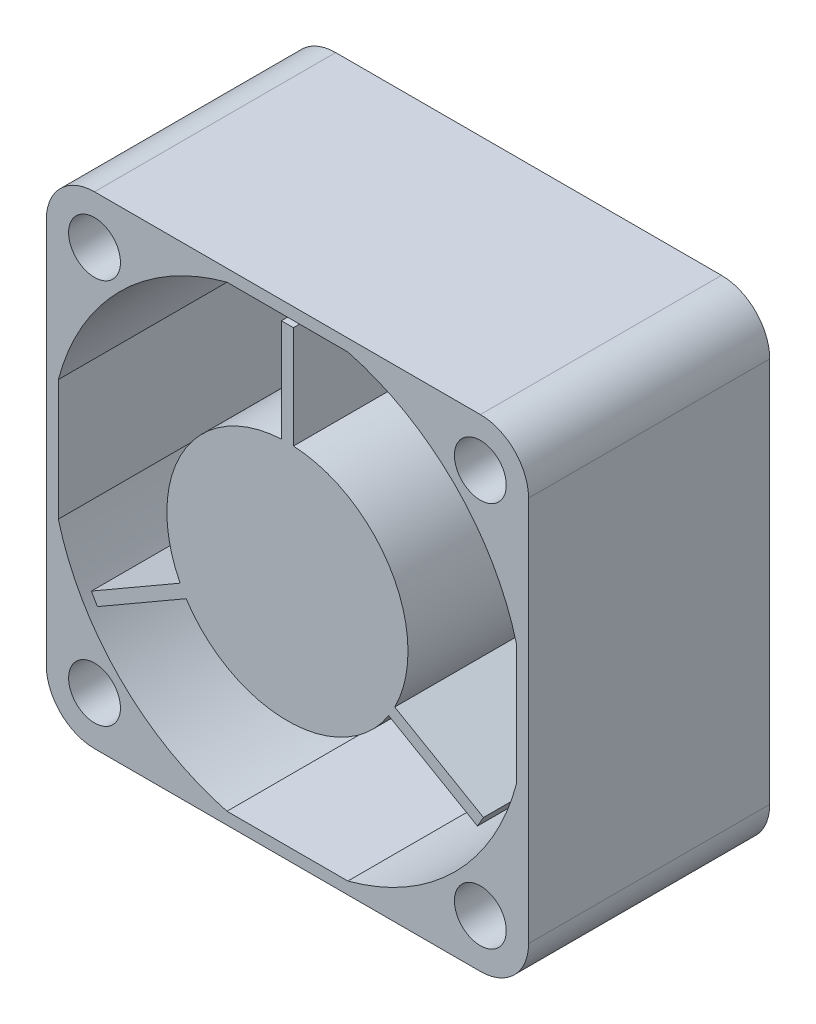
ISO-10303-21;
HEADER;
FILE_DESCRIPTION(('STEP AP214'),'2;1');
FILE_NAME('part.step','',(''),(''),'','','');
FILE_SCHEMA(('AUTOMOTIVE_DESIGN { 1 0 10303 214 1 1 1 1 }'));
ENDSEC;
DATA;
#1=APPLICATION_CONTEXT('core data for automotive mechanical design processes');
#2=APPLICATION_PROTOCOL_DEFINITION('international standard','automotive_design',2000,#1);
#3=PRODUCT_CONTEXT('',#1,'mechanical');
#4=PRODUCT('Part','Part','',(#3));
#5=PRODUCT_RELATED_PRODUCT_CATEGORY('part','',(#4));
#6=PRODUCT_DEFINITION_FORMATION('','',#4);
#7=PRODUCT_DEFINITION_CONTEXT('part definition',#1,'design');
#8=PRODUCT_DEFINITION('design','',#6,#7);
#9=PRODUCT_DEFINITION_SHAPE('','',#8);
#10=(LENGTH_UNIT() NAMED_UNIT(*) SI_UNIT(.MILLI.,.METRE.));
#11=(NAMED_UNIT(*) PLANE_ANGLE_UNIT() SI_UNIT($,.RADIAN.));
#12=(NAMED_UNIT(*) SI_UNIT($,.STERADIAN.) SOLID_ANGLE_UNIT());
#13=UNCERTAINTY_MEASURE_WITH_UNIT(LENGTH_MEASURE(1.E-05),#10,'distance_accuracy_value','');
#14=(GEOMETRIC_REPRESENTATION_CONTEXT(3) GLOBAL_UNCERTAINTY_ASSIGNED_CONTEXT((#13)) GLOBAL_UNIT_ASSIGNED_CONTEXT((#10,
#11,#12)) REPRESENTATION_CONTEXT('',''));
#15=CARTESIAN_POINT('',(0.,0.,0.));
#16=DIRECTION('',(0.,0.,1.));
#17=DIRECTION('',(1.,0.,0.));
#18=AXIS2_PLACEMENT_3D('',#15,#16,#17);
#19=CARTESIAN_POINT('',(-0.5,18.4874921777191,-53.2339055302157));
#20=DIRECTION('',(-1.,0.,0.));
#21=DIRECTION('',(0.,-1.,0.));
#22=AXIS2_PLACEMENT_3D('',#19,#20,#21);
#23=PLANE('',#22);
#24=DIRECTION('',(0.,1.,0.));
#25=VECTOR('',#24,1.);
#26=CARTESIAN_POINT('',(-0.5,18.4874921777191,-10.));
#27=LINE('',#26,#25);
#28=CARTESIAN_POINT('',(-0.5,9.98749217771909,-10.));
#29=VERTEX_POINT('',#28);
#30=CARTESIAN_POINT('',(-0.5,18.4874921777191,-10.));
#31=VERTEX_POINT('',#30);
#32=EDGE_CURVE('E49',#29,#31,#27,.T.);
#33=ORIENTED_EDGE('',*,*,#32,.F.);
#34=DIRECTION('',(0.,0.,1.));
#35=VECTOR('',#34,1.);
#36=CARTESIAN_POINT('',(-0.5,9.98749217771909,-53.2339055302157));
#37=LINE('',#36,#35);
#38=CARTESIAN_POINT('',(-0.5,9.98749217771909,10.));
#39=VERTEX_POINT('',#38);
#40=EDGE_CURVE('E123',#29,#39,#37,.T.);
#41=ORIENTED_EDGE('',*,*,#40,.T.);
#42=DIRECTION('',(0.,-1.,0.));
#43=VECTOR('',#42,1.);
#44=CARTESIAN_POINT('',(-0.5,18.4874921777191,10.));
#45=LINE('',#44,#43);
#46=CARTESIAN_POINT('',(-0.5,18.4874921777191,10.));
#47=VERTEX_POINT('',#46);
#48=EDGE_CURVE('E227',#47,#39,#45,.T.);
#49=ORIENTED_EDGE('',*,*,#48,.F.);
#50=DIRECTION('',(0.,0.,1.));
#51=VECTOR('',#50,1.);
#52=CARTESIAN_POINT('',(-0.5,18.4874921777191,-53.2339055302157));
#53=LINE('',#52,#51);
#54=EDGE_CURVE('E143',#31,#47,#53,.T.);
#55=ORIENTED_EDGE('',*,*,#54,.F.);
#56=EDGE_LOOP('',(#33,#41,#49,#55));
#57=FACE_BOUND('',#56,.T.);
#58=ADVANCED_FACE('F41',(#57),#23,.T.);
#59=CARTESIAN_POINT('',(-0.5,18.4874921777191,-53.2339055302157));
#60=DIRECTION('',(0.,1.,0.));
#61=DIRECTION('',(0.,0.,1.));
#62=AXIS2_PLACEMENT_3D('',#59,#60,#61);
#63=PLANE('',#62);
#64=DIRECTION('',(1.,0.,0.));
#65=VECTOR('',#64,1.);
#66=CARTESIAN_POINT('',(-0.5,18.4874921777191,-10.));
#67=LINE('',#66,#65);
#68=CARTESIAN_POINT('',(0.5,18.4874921777191,-10.));
#69=VERTEX_POINT('',#68);
#70=EDGE_CURVE('E238',#31,#69,#67,.T.);
#71=ORIENTED_EDGE('',*,*,#70,.F.);
#72=ORIENTED_EDGE('',*,*,#54,.T.);
#73=DIRECTION('',(-1.,0.,0.));
#74=VECTOR('',#73,1.);
#75=CARTESIAN_POINT('',(-0.5,18.4874921777191,10.));
#76=LINE('',#75,#74);
#77=CARTESIAN_POINT('',(0.5,18.4874921777191,10.));
#78=VERTEX_POINT('',#77);
#79=EDGE_CURVE('E125',#78,#47,#76,.T.);
#80=ORIENTED_EDGE('',*,*,#79,.F.);
#81=DIRECTION('',(0.,0.,1.));
#82=VECTOR('',#81,1.);
#83=CARTESIAN_POINT('',(0.5,18.4874921777191,-53.2339055302157));
#84=LINE('',#83,#82);
#85=EDGE_CURVE('E146',#69,#78,#84,.T.);
#86=ORIENTED_EDGE('',*,*,#85,.F.);
#87=EDGE_LOOP('',(#71,#72,#80,#86));
#88=FACE_BOUND('',#87,.T.);
#89=ADVANCED_FACE('F265',(#88),#63,.T.);
#90=CARTESIAN_POINT('',(0.5,18.4874921777191,-53.2339055302157));
#91=DIRECTION('',(1.,0.,0.));
#92=DIRECTION('',(0.,1.,0.));
#93=AXIS2_PLACEMENT_3D('',#90,#91,#92);
#94=PLANE('',#93);
#95=DIRECTION('',(0.,-1.,0.));
#96=VECTOR('',#95,1.);
#97=CARTESIAN_POINT('',(0.5,18.4874921777191,-10.));
#98=LINE('',#97,#96);
#99=CARTESIAN_POINT('',(0.499999999999999,9.98749217771909,-10.));
#100=VERTEX_POINT('',#99);
#101=EDGE_CURVE('E240',#69,#100,#98,.T.);
#102=ORIENTED_EDGE('',*,*,#101,.F.);
#103=ORIENTED_EDGE('',*,*,#85,.T.);
#104=DIRECTION('',(0.,1.,0.));
#105=VECTOR('',#104,1.);
#106=CARTESIAN_POINT('',(0.5,18.4874921777191,10.));
#107=LINE('',#106,#105);
#108=CARTESIAN_POINT('',(0.499999999999999,9.98749217771909,10.));
#109=VERTEX_POINT('',#108);
#110=EDGE_CURVE('E132',#109,#78,#107,.T.);
#111=ORIENTED_EDGE('',*,*,#110,.F.);
#112=DIRECTION('',(0.,0.,1.));
#113=VECTOR('',#112,1.);
#114=CARTESIAN_POINT('',(0.499999999999999,9.98749217771909,-53.2339055302157));
#115=LINE('',#114,#113);
#116=EDGE_CURVE('E149',#100,#109,#115,.T.);
#117=ORIENTED_EDGE('',*,*,#116,.F.);
#118=EDGE_LOOP('',(#102,#103,#111,#117));
#119=FACE_BOUND('',#118,.T.);
#120=ADVANCED_FACE('F262',(#119),#94,.T.);
#121=CARTESIAN_POINT('',(0.,0.,-53.2339055302157));
#122=DIRECTION('',(0.,0.,1.));
#123=DIRECTION('',(1.,0.,0.));
#124=AXIS2_PLACEMENT_3D('',#121,#122,#123);
#125=CYLINDRICAL_SURFACE('',#124,10.);
#126=CARTESIAN_POINT('',(0.,0.,-10.));
#127=DIRECTION('',(0.,0.,1.));
#128=DIRECTION('',(1.,0.,0.));
#129=AXIS2_PLACEMENT_3D('',#126,#127,#128);
#130=CIRCLE('',#129,10.);
#131=CARTESIAN_POINT('',(8.89942194600307,-4.56073338696737,-10.));
#132=VERTEX_POINT('',#131);
#133=EDGE_CURVE('E242',#100,#132,#130,.F.);
#134=ORIENTED_EDGE('',*,*,#133,.F.);
#135=ORIENTED_EDGE('',*,*,#116,.T.);
#136=CARTESIAN_POINT('',(0.,0.,10.));
#137=DIRECTION('',(0.,0.,1.));
#138=DIRECTION('',(1.,0.,0.));
#139=AXIS2_PLACEMENT_3D('',#136,#137,#138);
#140=CIRCLE('',#139,10.);
#141=CARTESIAN_POINT('',(8.89942194600307,-4.56073338696738,10.));
#142=VERTEX_POINT('',#141);
#143=EDGE_CURVE('E139',#142,#109,#140,.T.);
#144=ORIENTED_EDGE('',*,*,#143,.F.);
#145=DIRECTION('',(0.,0.,1.));
#146=VECTOR('',#145,1.);
#147=CARTESIAN_POINT('',(8.89942194600307,-4.56073338696738,-53.2339055302157));
#148=LINE('',#147,#146);
#149=EDGE_CURVE('E152',#132,#142,#148,.T.);
#150=ORIENTED_EDGE('',*,*,#149,.F.);
#151=EDGE_LOOP('',(#134,#135,#144,#150));
#152=FACE_BOUND('',#151,.T.);
#153=ADVANCED_FACE('F202',(#152),#125,.T.);
#154=CARTESIAN_POINT('',(16.2606378781708,-8.8107333869674,-53.2339055302157));
#155=DIRECTION('',(0.500000000000004,0.866025403784436,0.));
#156=DIRECTION('',(-0.866025403784436,0.500000000000004,0.));
#157=AXIS2_PLACEMENT_3D('',#154,#155,#156);
#158=PLANE('',#157);
#159=DIRECTION('',(0.866025403784436,-0.500000000000004,0.));
#160=VECTOR('',#159,1.);
#161=CARTESIAN_POINT('',(16.2606378781708,-8.8107333869674,-10.));
#162=LINE('',#161,#160);
#163=CARTESIAN_POINT('',(16.2606378781708,-8.8107333869674,-10.));
#164=VERTEX_POINT('',#163);
#165=EDGE_CURVE('E244',#132,#164,#162,.T.);
#166=ORIENTED_EDGE('',*,*,#165,.F.);
#167=ORIENTED_EDGE('',*,*,#149,.T.);
#168=DIRECTION('',(-0.866025403784436,0.500000000000004,0.));
#169=VECTOR('',#168,1.);
#170=CARTESIAN_POINT('',(16.2606378781708,-8.8107333869674,10.));
#171=LINE('',#170,#169);
#172=CARTESIAN_POINT('',(16.2606378781708,-8.8107333869674,10.));
#173=VERTEX_POINT('',#172);
#174=EDGE_CURVE('E189',#173,#142,#171,.T.);
#175=ORIENTED_EDGE('',*,*,#174,.F.);
#176=DIRECTION('',(0.,0.,1.));
#177=VECTOR('',#176,1.);
#178=CARTESIAN_POINT('',(16.2606378781708,-8.8107333869674,-53.2339055302157));
#179=LINE('',#178,#177);
#180=EDGE_CURVE('E155',#164,#173,#179,.T.);
#181=ORIENTED_EDGE('',*,*,#180,.F.);
#182=EDGE_LOOP('',(#166,#167,#175,#181));
#183=FACE_BOUND('',#182,.T.);
#184=ADVANCED_FACE('F254',(#183),#158,.T.);
#185=CARTESIAN_POINT('',(15.7606378781708,-9.67675879075184,-53.2339055302157));
#186=DIRECTION('',(0.866025403784439,-0.5,0.));
#187=DIRECTION('',(0.5,0.866025403784439,0.));
#188=AXIS2_PLACEMENT_3D('',#185,#186,#187);
#189=PLANE('',#188);
#190=DIRECTION('',(-0.5,-0.866025403784439,0.));
#191=VECTOR('',#190,1.);
#192=CARTESIAN_POINT('',(15.7606378781708,-9.67675879075184,-10.));
#193=LINE('',#192,#191);
#194=CARTESIAN_POINT('',(15.7606378781708,-9.67675879075184,-10.));
#195=VERTEX_POINT('',#194);
#196=EDGE_CURVE('E246',#164,#195,#193,.T.);
#197=ORIENTED_EDGE('',*,*,#196,.F.);
#198=ORIENTED_EDGE('',*,*,#180,.T.);
#199=DIRECTION('',(0.5,0.866025403784439,0.));
#200=VECTOR('',#199,1.);
#201=CARTESIAN_POINT('',(15.7606378781708,-9.67675879075184,10.));
#202=LINE('',#201,#200);
#203=CARTESIAN_POINT('',(15.7606378781708,-9.67675879075184,10.));
#204=VERTEX_POINT('',#203);
#205=EDGE_CURVE('E180',#204,#173,#202,.T.);
#206=ORIENTED_EDGE('',*,*,#205,.F.);
#207=DIRECTION('',(0.,0.,1.));
#208=VECTOR('',#207,1.);
#209=CARTESIAN_POINT('',(15.7606378781708,-9.67675879075184,-53.2339055302157));
#210=LINE('',#209,#208);
#211=EDGE_CURVE('E158',#195,#204,#210,.T.);
#212=ORIENTED_EDGE('',*,*,#211,.F.);
#213=EDGE_LOOP('',(#197,#198,#206,#212));
#214=FACE_BOUND('',#213,.T.);
#215=ADVANCED_FACE('F252',(#214),#189,.T.);
#216=CARTESIAN_POINT('',(8.39942194600307,-5.4267587907518,-53.2339055302157));
#217=DIRECTION('',(-0.500000000000004,-0.866025403784436,0.));
#218=DIRECTION('',(0.866025403784436,-0.500000000000004,0.));
#219=AXIS2_PLACEMENT_3D('',#216,#217,#218);
#220=PLANE('',#219);
#221=DIRECTION('',(-0.866025403784436,0.500000000000004,0.));
#222=VECTOR('',#221,1.);
#223=CARTESIAN_POINT('',(8.39942194600307,-5.4267587907518,-10.));
#224=LINE('',#223,#222);
#225=CARTESIAN_POINT('',(8.39942194600307,-5.4267587907518,-10.));
#226=VERTEX_POINT('',#225);
#227=EDGE_CURVE('E248',#195,#226,#224,.T.);
#228=ORIENTED_EDGE('',*,*,#227,.F.);
#229=ORIENTED_EDGE('',*,*,#211,.T.);
#230=DIRECTION('',(0.866025403784436,-0.500000000000004,0.));
#231=VECTOR('',#230,1.);
#232=CARTESIAN_POINT('',(8.39942194600307,-5.4267587907518,10.));
#233=LINE('',#232,#231);
#234=CARTESIAN_POINT('',(8.39942194600307,-5.4267587907518,10.));
#235=VERTEX_POINT('',#234);
#236=EDGE_CURVE('E175',#235,#204,#233,.T.);
#237=ORIENTED_EDGE('',*,*,#236,.F.);
#238=DIRECTION('',(0.,0.,1.));
#239=VECTOR('',#238,1.);
#240=CARTESIAN_POINT('',(8.39942194600307,-5.4267587907518,-53.2339055302157));
#241=LINE('',#240,#239);
#242=EDGE_CURVE('E116',#226,#235,#241,.T.);
#243=ORIENTED_EDGE('',*,*,#242,.F.);
#244=EDGE_LOOP('',(#228,#229,#237,#243));
#245=FACE_BOUND('',#244,.T.);
#246=ADVANCED_FACE('F176',(#245),#220,.T.);
#247=CARTESIAN_POINT('',(0.,0.,-53.2339055302157));
#248=DIRECTION('',(0.,0.,1.));
#249=DIRECTION('',(1.,0.,0.));
#250=AXIS2_PLACEMENT_3D('',#247,#248,#249);
#251=CYLINDRICAL_SURFACE('',#250,10.);
#252=CARTESIAN_POINT('',(0.,0.,-10.));
#253=DIRECTION('',(0.,0.,1.));
#254=DIRECTION('',(1.,0.,0.));
#255=AXIS2_PLACEMENT_3D('',#252,#253,#254);
#256=CIRCLE('',#255,10.);
#257=CARTESIAN_POINT('',(-8.39942194600307,-5.42675879075181,-10.));
#258=VERTEX_POINT('',#257);
#259=EDGE_CURVE('E92',#226,#258,#256,.F.);
#260=ORIENTED_EDGE('',*,*,#259,.F.);
#261=ORIENTED_EDGE('',*,*,#242,.T.);
#262=CARTESIAN_POINT('',(0.,0.,10.));
#263=DIRECTION('',(0.,0.,1.));
#264=DIRECTION('',(1.,0.,0.));
#265=AXIS2_PLACEMENT_3D('',#262,#263,#264);
#266=CIRCLE('',#265,10.);
#267=CARTESIAN_POINT('',(-8.39942194600307,-5.4267587907518,10.));
#268=VERTEX_POINT('',#267);
#269=EDGE_CURVE('E169',#268,#235,#266,.T.);
#270=ORIENTED_EDGE('',*,*,#269,.F.);
#271=DIRECTION('',(0.,0.,1.));
#272=VECTOR('',#271,1.);
#273=CARTESIAN_POINT('',(-8.39942194600307,-5.4267587907518,-53.2339055302157));
#274=LINE('',#273,#272);
#275=EDGE_CURVE('E114',#258,#268,#274,.T.);
#276=ORIENTED_EDGE('',*,*,#275,.F.);
#277=EDGE_LOOP('',(#260,#261,#270,#276));
#278=FACE_BOUND('',#277,.T.);
#279=ADVANCED_FACE('F166',(#278),#251,.T.);
#280=CARTESIAN_POINT('',(-15.7606378781708,-9.67675879075184,-53.2339055302157));
#281=DIRECTION('',(0.500000000000004,-0.866025403784436,0.));
#282=DIRECTION('',(0.866025403784436,0.500000000000004,0.));
#283=AXIS2_PLACEMENT_3D('',#280,#281,#282);
#284=PLANE('',#283);
#285=DIRECTION('',(-0.866025403784436,-0.500000000000004,0.));
#286=VECTOR('',#285,1.);
#287=CARTESIAN_POINT('',(-15.7606378781708,-9.67675879075184,-10.));
#288=LINE('',#287,#286);
#289=CARTESIAN_POINT('',(-15.7606378781708,-9.67675879075184,-10.));
#290=VERTEX_POINT('',#289);
#291=EDGE_CURVE('E86',#258,#290,#288,.T.);
#292=ORIENTED_EDGE('',*,*,#291,.F.);
#293=ORIENTED_EDGE('',*,*,#275,.T.);
#294=DIRECTION('',(0.866025403784436,0.500000000000004,0.));
#295=VECTOR('',#294,1.);
#296=CARTESIAN_POINT('',(-15.7606378781708,-9.67675879075184,10.));
#297=LINE('',#296,#295);
#298=CARTESIAN_POINT('',(-15.7606378781708,-9.67675879075184,10.));
#299=VERTEX_POINT('',#298);
#300=EDGE_CURVE('E112',#299,#268,#297,.T.);
#301=ORIENTED_EDGE('',*,*,#300,.F.);
#302=DIRECTION('',(0.,0.,1.));
#303=VECTOR('',#302,1.);
#304=CARTESIAN_POINT('',(-15.7606378781708,-9.67675879075184,-53.2339055302157));
#305=LINE('',#304,#303);
#306=EDGE_CURVE('E104',#290,#299,#305,.T.);
#307=ORIENTED_EDGE('',*,*,#306,.F.);
#308=EDGE_LOOP('',(#292,#293,#301,#307));
#309=FACE_BOUND('',#308,.T.);
#310=ADVANCED_FACE('F110',(#309),#284,.T.);
#311=CARTESIAN_POINT('',(-16.2606378781708,-8.8107333869674,-53.2339055302157));
#312=DIRECTION('',(-0.866025403784436,-0.500000000000005,0.));
#313=DIRECTION('',(0.500000000000005,-0.866025403784436,0.));
#314=AXIS2_PLACEMENT_3D('',#311,#312,#313);
#315=PLANE('',#314);
#316=DIRECTION('',(-0.500000000000005,0.866025403784436,0.));
#317=VECTOR('',#316,1.);
#318=CARTESIAN_POINT('',(-16.2606378781708,-8.8107333869674,-10.));
#319=LINE('',#318,#317);
#320=CARTESIAN_POINT('',(-16.2606378781708,-8.81073338696741,-10.));
#321=VERTEX_POINT('',#320);
#322=EDGE_CURVE('E89',#290,#321,#319,.T.);
#323=ORIENTED_EDGE('',*,*,#322,.F.);
#324=ORIENTED_EDGE('',*,*,#306,.T.);
#325=DIRECTION('',(0.500000000000005,-0.866025403784436,0.));
#326=VECTOR('',#325,1.);
#327=CARTESIAN_POINT('',(-16.2606378781708,-8.8107333869674,10.));
#328=LINE('',#327,#326);
#329=CARTESIAN_POINT('',(-16.2606378781708,-8.8107333869674,10.));
#330=VERTEX_POINT('',#329);
#331=EDGE_CURVE('E184',#330,#299,#328,.T.);
#332=ORIENTED_EDGE('',*,*,#331,.F.);
#333=DIRECTION('',(0.,0.,1.));
#334=VECTOR('',#333,1.);
#335=CARTESIAN_POINT('',(-16.2606378781708,-8.8107333869674,-53.2339055302157));
#336=LINE('',#335,#334);
#337=EDGE_CURVE('E107',#321,#330,#336,.T.);
#338=ORIENTED_EDGE('',*,*,#337,.F.);
#339=EDGE_LOOP('',(#323,#324,#332,#338));
#340=FACE_BOUND('',#339,.T.);
#341=ADVANCED_FACE('F101',(#340),#315,.T.);
#342=CARTESIAN_POINT('',(-8.89942194600307,-4.56073338696737,-53.2339055302157));
#343=DIRECTION('',(-0.500000000000004,0.866025403784436,0.));
#344=DIRECTION('',(-0.866025403784436,-0.500000000000004,0.));
#345=AXIS2_PLACEMENT_3D('',#342,#343,#344);
#346=PLANE('',#345);
#347=DIRECTION('',(0.866025403784436,0.500000000000004,0.));
#348=VECTOR('',#347,1.);
#349=CARTESIAN_POINT('',(-8.89942194600307,-4.56073338696737,-10.));
#350=LINE('',#349,#348);
#351=CARTESIAN_POINT('',(-8.89942194600307,-4.56073338696737,-10.));
#352=VERTEX_POINT('',#351);
#353=EDGE_CURVE('E108',#321,#352,#350,.T.);
#354=ORIENTED_EDGE('',*,*,#353,.F.);
#355=ORIENTED_EDGE('',*,*,#337,.T.);
#356=DIRECTION('',(-0.866025403784436,-0.500000000000004,0.));
#357=VECTOR('',#356,1.);
#358=CARTESIAN_POINT('',(-8.89942194600307,-4.56073338696737,10.));
#359=LINE('',#358,#357);
#360=CARTESIAN_POINT('',(-8.89942194600307,-4.56073338696737,10.));
#361=VERTEX_POINT('',#360);
#362=EDGE_CURVE('E221',#361,#330,#359,.T.);
#363=ORIENTED_EDGE('',*,*,#362,.F.);
#364=DIRECTION('',(0.,0.,1.));
#365=VECTOR('',#364,1.);
#366=CARTESIAN_POINT('',(-8.89942194600307,-4.56073338696737,-53.2339055302157));
#367=LINE('',#366,#365);
#368=EDGE_CURVE('E118',#352,#361,#367,.T.);
#369=ORIENTED_EDGE('',*,*,#368,.F.);
#370=EDGE_LOOP('',(#354,#355,#363,#369));
#371=FACE_BOUND('',#370,.T.);
#372=ADVANCED_FACE('F218',(#371),#346,.T.);
#373=CARTESIAN_POINT('',(0.,0.,-53.2339055302157));
#374=DIRECTION('',(0.,0.,1.));
#375=DIRECTION('',(1.,0.,0.));
#376=AXIS2_PLACEMENT_3D('',#373,#374,#375);
#377=CYLINDRICAL_SURFACE('',#376,10.);
#378=CARTESIAN_POINT('',(0.,0.,-10.));
#379=DIRECTION('',(0.,0.,1.));
#380=DIRECTION('',(1.,0.,0.));
#381=AXIS2_PLACEMENT_3D('',#378,#379,#380);
#382=CIRCLE('',#381,10.);
#383=EDGE_CURVE('E12',#352,#29,#382,.F.);
#384=ORIENTED_EDGE('',*,*,#383,.F.);
#385=ORIENTED_EDGE('',*,*,#368,.T.);
#386=CARTESIAN_POINT('',(0.,0.,10.));
#387=DIRECTION('',(0.,0.,1.));
#388=DIRECTION('',(1.,0.,0.));
#389=AXIS2_PLACEMENT_3D('',#386,#387,#388);
#390=CIRCLE('',#389,10.);
#391=EDGE_CURVE('E225',#39,#361,#390,.T.);
#392=ORIENTED_EDGE('',*,*,#391,.F.);
#393=ORIENTED_EDGE('',*,*,#40,.F.);
#394=EDGE_LOOP('',(#384,#385,#392,#393));
#395=FACE_BOUND('',#394,.T.);
#396=ADVANCED_FACE('F224',(#395),#377,.T.);
#397=CARTESIAN_POINT('',(0.,0.,10.));
#398=DIRECTION('',(0.,0.,1.));
#399=DIRECTION('',(1.,0.,0.));
#400=AXIS2_PLACEMENT_3D('',#397,#398,#399);
#401=PLANE('',#400);
#402=ORIENTED_EDGE('',*,*,#48,.T.);
#403=ORIENTED_EDGE('',*,*,#391,.T.);
#404=ORIENTED_EDGE('',*,*,#362,.T.);
#405=ORIENTED_EDGE('',*,*,#331,.T.);
#406=ORIENTED_EDGE('',*,*,#300,.T.);
#407=ORIENTED_EDGE('',*,*,#269,.T.);
#408=ORIENTED_EDGE('',*,*,#236,.T.);
#409=ORIENTED_EDGE('',*,*,#205,.T.);
#410=ORIENTED_EDGE('',*,*,#174,.T.);
#411=ORIENTED_EDGE('',*,*,#143,.T.);
#412=ORIENTED_EDGE('',*,*,#110,.T.);
#413=ORIENTED_EDGE('',*,*,#79,.T.);
#414=EDGE_LOOP('',(#402,#403,#404,#405,#406,#407,#408,#409,#410,#411,#412,#413));
#415=FACE_BOUND('',#414,.T.);
#416=ADVANCED_FACE('F182',(#415),#401,.T.);
#417=CARTESIAN_POINT('',(-20.,-20.,-10.));
#418=DIRECTION('',(0.,0.,1.));
#419=DIRECTION('',(1.,0.,0.));
#420=AXIS2_PLACEMENT_3D('',#417,#418,#419);
#421=PLANE('',#420);
#422=ORIENTED_EDGE('',*,*,#32,.T.);
#423=ORIENTED_EDGE('',*,*,#70,.T.);
#424=ORIENTED_EDGE('',*,*,#101,.T.);
#425=ORIENTED_EDGE('',*,*,#133,.T.);
#426=ORIENTED_EDGE('',*,*,#165,.T.);
#427=ORIENTED_EDGE('',*,*,#196,.T.);
#428=ORIENTED_EDGE('',*,*,#227,.T.);
#429=ORIENTED_EDGE('',*,*,#259,.T.);
#430=ORIENTED_EDGE('',*,*,#291,.T.);
#431=ORIENTED_EDGE('',*,*,#322,.T.);
#432=ORIENTED_EDGE('',*,*,#353,.T.);
#433=ORIENTED_EDGE('',*,*,#383,.T.);
#434=EDGE_LOOP('',(#422,#423,#424,#425,#426,#427,#428,#429,#430,#431,#432,#433));
#435=FACE_BOUND('',#434,.T.);
#436=ADVANCED_FACE('F88',(#435),#421,.F.);
#437=CLOSED_SHELL('',(#58,#89,#120,#153,#184,#215,#246,#279,#310,#341,#372,#396,#416,#436));
#438=MANIFOLD_SOLID_BREP('B2',#437);
#439=CARTESIAN_POINT('',(-20.,20.,-10.));
#440=DIRECTION('',(-1.,0.,0.));
#441=DIRECTION('',(0.,0.,1.));
#442=AXIS2_PLACEMENT_3D('',#439,#440,#441);
#443=PLANE('',#442);
#444=DIRECTION('',(0.,-1.,0.));
#445=VECTOR('',#444,1.);
#446=CARTESIAN_POINT('',(-20.,20.,-10.));
#447=LINE('',#446,#445);
#448=CARTESIAN_POINT('',(-20.,16.,-10.));
#449=VERTEX_POINT('',#448);
#450=CARTESIAN_POINT('',(-20.,-16.,-10.));
#451=VERTEX_POINT('',#450);
#452=EDGE_CURVE('E599',#449,#451,#447,.T.);
#453=ORIENTED_EDGE('',*,*,#452,.T.);
#454=DIRECTION('',(0.,0.,1.));
#455=VECTOR('',#454,1.);
#456=CARTESIAN_POINT('',(-20.,-16.,-10.));
#457=LINE('',#456,#455);
#458=CARTESIAN_POINT('',(-20.,-16.,10.));
#459=VERTEX_POINT('',#458);
#460=EDGE_CURVE('E612',#451,#459,#457,.T.);
#461=ORIENTED_EDGE('',*,*,#460,.T.);
#462=DIRECTION('',(0.,-1.,0.));
#463=VECTOR('',#462,1.);
#464=CARTESIAN_POINT('',(-20.,20.,10.));
#465=LINE('',#464,#463);
#466=CARTESIAN_POINT('',(-20.,16.,10.));
#467=VERTEX_POINT('',#466);
#468=EDGE_CURVE('E543',#467,#459,#465,.T.);
#469=ORIENTED_EDGE('',*,*,#468,.F.);
#470=DIRECTION('',(0.,0.,1.));
#471=VECTOR('',#470,1.);
#472=CARTESIAN_POINT('',(-20.,16.,-10.));
#473=LINE('',#472,#471);
#474=EDGE_CURVE('E610',#467,#449,#473,.F.);
#475=ORIENTED_EDGE('',*,*,#474,.T.);
#476=EDGE_LOOP('',(#453,#461,#469,#475));
#477=FACE_BOUND('',#476,.T.);
#478=ADVANCED_FACE('F373',(#477),#443,.T.);
#479=CARTESIAN_POINT('',(-20.,20.,-10.));
#480=DIRECTION('',(0.,1.,0.));
#481=DIRECTION('',(0.,0.,1.));
#482=AXIS2_PLACEMENT_3D('',#479,#480,#481);
#483=PLANE('',#482);
#484=DIRECTION('',(-1.,0.,0.));
#485=VECTOR('',#484,1.);
#486=CARTESIAN_POINT('',(-20.,20.,10.));
#487=LINE('',#486,#485);
#488=CARTESIAN_POINT('',(16.,20.,10.));
#489=VERTEX_POINT('',#488);
#490=CARTESIAN_POINT('',(-16.,20.,10.));
#491=VERTEX_POINT('',#490);
#492=EDGE_CURVE('E552',#489,#491,#487,.T.);
#493=ORIENTED_EDGE('',*,*,#492,.F.);
#494=DIRECTION('',(0.,0.,1.));
#495=VECTOR('',#494,1.);
#496=CARTESIAN_POINT('',(16.,20.,-10.));
#497=LINE('',#496,#495);
#498=CARTESIAN_POINT('',(16.,20.,-10.));
#499=VERTEX_POINT('',#498);
#500=EDGE_CURVE('E39',#489,#499,#497,.F.);
#501=ORIENTED_EDGE('',*,*,#500,.T.);
#502=DIRECTION('',(-1.,0.,0.));
#503=VECTOR('',#502,1.);
#504=CARTESIAN_POINT('',(-20.,20.,-10.));
#505=LINE('',#504,#503);
#506=CARTESIAN_POINT('',(-16.,20.,-10.));
#507=VERTEX_POINT('',#506);
#508=EDGE_CURVE('E607',#499,#507,#505,.T.);
#509=ORIENTED_EDGE('',*,*,#508,.T.);
#510=DIRECTION('',(0.,0.,1.));
#511=VECTOR('',#510,1.);
#512=CARTESIAN_POINT('',(-16.,20.,-10.));
#513=LINE('',#512,#511);
#514=EDGE_CURVE('E381',#507,#491,#513,.T.);
#515=ORIENTED_EDGE('',*,*,#514,.T.);
#516=EDGE_LOOP('',(#493,#501,#509,#515));
#517=FACE_BOUND('',#516,.T.);
#518=ADVANCED_FACE('F642',(#517),#483,.T.);
#519=CARTESIAN_POINT('',(20.,20.,-10.));
#520=DIRECTION('',(1.,0.,0.));
#521=DIRECTION('',(0.,1.,0.));
#522=AXIS2_PLACEMENT_3D('',#519,#520,#521);
#523=PLANE('',#522);
#524=DIRECTION('',(0.,1.,0.));
#525=VECTOR('',#524,1.);
#526=CARTESIAN_POINT('',(20.,20.,10.));
#527=LINE('',#526,#525);
#528=CARTESIAN_POINT('',(20.,-16.,10.));
#529=VERTEX_POINT('',#528);
#530=CARTESIAN_POINT('',(20.,16.,10.));
#531=VERTEX_POINT('',#530);
#532=EDGE_CURVE('E549',#529,#531,#527,.T.);
#533=ORIENTED_EDGE('',*,*,#532,.F.);
#534=DIRECTION('',(0.,0.,1.));
#535=VECTOR('',#534,1.);
#536=CARTESIAN_POINT('',(20.,-16.,-10.));
#537=LINE('',#536,#535);
#538=CARTESIAN_POINT('',(20.,-16.,-10.));
#539=VERTEX_POINT('',#538);
#540=EDGE_CURVE('E395',#529,#539,#537,.F.);
#541=ORIENTED_EDGE('',*,*,#540,.T.);
#542=DIRECTION('',(0.,1.,0.));
#543=VECTOR('',#542,1.);
#544=CARTESIAN_POINT('',(20.,20.,-10.));
#545=LINE('',#544,#543);
#546=CARTESIAN_POINT('',(20.,16.,-10.));
#547=VERTEX_POINT('',#546);
#548=EDGE_CURVE('E605',#539,#547,#545,.T.);
#549=ORIENTED_EDGE('',*,*,#548,.T.);
#550=DIRECTION('',(0.,0.,1.));
#551=VECTOR('',#550,1.);
#552=CARTESIAN_POINT('',(20.,16.,-10.));
#553=LINE('',#552,#551);
#554=EDGE_CURVE('E635',#547,#531,#553,.T.);
#555=ORIENTED_EDGE('',*,*,#554,.T.);
#556=EDGE_LOOP('',(#533,#541,#549,#555));
#557=FACE_BOUND('',#556,.T.);
#558=ADVANCED_FACE('F652',(#557),#523,.T.);
#559=CARTESIAN_POINT('',(-20.,-20.,-10.));
#560=DIRECTION('',(0.,-1.,0.));
#561=DIRECTION('',(0.,0.,-1.));
#562=AXIS2_PLACEMENT_3D('',#559,#560,#561);
#563=PLANE('',#562);
#564=DIRECTION('',(1.,0.,0.));
#565=VECTOR('',#564,1.);
#566=CARTESIAN_POINT('',(-20.,-20.,10.));
#567=LINE('',#566,#565);
#568=CARTESIAN_POINT('',(-16.,-20.,10.));
#569=VERTEX_POINT('',#568);
#570=CARTESIAN_POINT('',(16.,-20.,10.));
#571=VERTEX_POINT('',#570);
#572=EDGE_CURVE('E546',#569,#571,#567,.T.);
#573=ORIENTED_EDGE('',*,*,#572,.F.);
#574=DIRECTION('',(0.,0.,1.));
#575=VECTOR('',#574,1.);
#576=CARTESIAN_POINT('',(-16.,-20.,-10.));
#577=LINE('',#576,#575);
#578=CARTESIAN_POINT('',(-16.,-20.,-10.));
#579=VERTEX_POINT('',#578);
#580=EDGE_CURVE('E626',#569,#579,#577,.F.);
#581=ORIENTED_EDGE('',*,*,#580,.T.);
#582=DIRECTION('',(1.,0.,0.));
#583=VECTOR('',#582,1.);
#584=CARTESIAN_POINT('',(-20.,-20.,-10.));
#585=LINE('',#584,#583);
#586=CARTESIAN_POINT('',(16.,-20.,-10.));
#587=VERTEX_POINT('',#586);
#588=EDGE_CURVE('E602',#579,#587,#585,.T.);
#589=ORIENTED_EDGE('',*,*,#588,.T.);
#590=DIRECTION('',(0.,0.,1.));
#591=VECTOR('',#590,1.);
#592=CARTESIAN_POINT('',(16.,-20.,-10.));
#593=LINE('',#592,#591);
#594=EDGE_CURVE('E623',#587,#571,#593,.T.);
#595=ORIENTED_EDGE('',*,*,#594,.T.);
#596=EDGE_LOOP('',(#573,#581,#589,#595));
#597=FACE_BOUND('',#596,.T.);
#598=ADVANCED_FACE('F661',(#597),#563,.T.);
#599=CARTESIAN_POINT('',(-20.,-20.,-10.));
#600=DIRECTION('',(0.,0.,1.));
#601=DIRECTION('',(1.,0.,0.));
#602=AXIS2_PLACEMENT_3D('',#599,#600,#601);
#603=PLANE('',#602);
#604=DIRECTION('',(-1.,0.,0.));
#605=VECTOR('',#604,1.);
#606=CARTESIAN_POINT('',(-5.01223503040308,19.,-10.));
#607=LINE('',#606,#605);
#608=CARTESIAN_POINT('',(5.01223503040308,19.,-10.));
#609=VERTEX_POINT('',#608);
#610=CARTESIAN_POINT('',(-5.01223503040308,19.,-10.));
#611=VERTEX_POINT('',#610);
#612=EDGE_CURVE('E500',#609,#611,#607,.T.);
#613=ORIENTED_EDGE('',*,*,#612,.T.);
#614=CARTESIAN_POINT('',(0.,0.,-10.));
#615=DIRECTION('',(0.,0.,1.));
#616=DIRECTION('',(1.,0.,0.));
#617=AXIS2_PLACEMENT_3D('',#614,#615,#616);
#618=CIRCLE('',#617,19.65);
#619=CARTESIAN_POINT('',(-19.,5.01223503040308,-10.));
#620=VERTEX_POINT('',#619);
#621=EDGE_CURVE('E555',#611,#620,#618,.T.);
#622=ORIENTED_EDGE('',*,*,#621,.T.);
#623=DIRECTION('',(0.,-1.,0.));
#624=VECTOR('',#623,1.);
#625=CARTESIAN_POINT('',(-19.,-5.01223503040308,-10.));
#626=LINE('',#625,#624);
#627=CARTESIAN_POINT('',(-19.,-5.01223503040307,-10.));
#628=VERTEX_POINT('',#627);
#629=EDGE_CURVE('E495',#620,#628,#626,.T.);
#630=ORIENTED_EDGE('',*,*,#629,.T.);
#631=CARTESIAN_POINT('',(0.,0.,-10.));
#632=DIRECTION('',(0.,0.,1.));
#633=DIRECTION('',(1.,0.,0.));
#634=AXIS2_PLACEMENT_3D('',#631,#632,#633);
#635=CIRCLE('',#634,19.65);
#636=CARTESIAN_POINT('',(-5.01223503040308,-19.,-10.));
#637=VERTEX_POINT('',#636);
#638=EDGE_CURVE('E558',#628,#637,#635,.T.);
#639=ORIENTED_EDGE('',*,*,#638,.T.);
#640=DIRECTION('',(1.,0.,0.));
#641=VECTOR('',#640,1.);
#642=CARTESIAN_POINT('',(5.01223503040308,-19.,-10.));
#643=LINE('',#642,#641);
#644=CARTESIAN_POINT('',(5.01223503040308,-19.,-10.));
#645=VERTEX_POINT('',#644);
#646=EDGE_CURVE('E561',#637,#645,#643,.T.);
#647=ORIENTED_EDGE('',*,*,#646,.T.);
#648=CARTESIAN_POINT('',(0.,0.,-10.));
#649=DIRECTION('',(0.,0.,1.));
#650=DIRECTION('',(1.,0.,0.));
#651=AXIS2_PLACEMENT_3D('',#648,#649,#650);
#652=CIRCLE('',#651,19.65);
#653=CARTESIAN_POINT('',(19.,-5.01223503040308,-10.));
#654=VERTEX_POINT('',#653);
#655=EDGE_CURVE('E564',#645,#654,#652,.T.);
#656=ORIENTED_EDGE('',*,*,#655,.T.);
#657=DIRECTION('',(0.,1.,0.));
#658=VECTOR('',#657,1.);
#659=CARTESIAN_POINT('',(19.,5.01223503040308,-10.));
#660=LINE('',#659,#658);
#661=CARTESIAN_POINT('',(19.,5.01223503040308,-10.));
#662=VERTEX_POINT('',#661);
#663=EDGE_CURVE('E567',#654,#662,#660,.T.);
#664=ORIENTED_EDGE('',*,*,#663,.T.);
#665=CARTESIAN_POINT('',(0.,0.,-10.));
#666=DIRECTION('',(0.,0.,1.));
#667=DIRECTION('',(1.,0.,0.));
#668=AXIS2_PLACEMENT_3D('',#665,#666,#667);
#669=CIRCLE('',#668,19.65);
#670=EDGE_CURVE('E570',#662,#609,#669,.T.);
#671=ORIENTED_EDGE('',*,*,#670,.T.);
#672=EDGE_LOOP('',(#613,#622,#630,#639,#647,#656,#664,#671));
#673=FACE_BOUND('',#672,.T.);
#674=CARTESIAN_POINT('',(-16.,-16.,-10.));
#675=DIRECTION('',(0.,0.,1.));
#676=DIRECTION('',(1.,0.,0.));
#677=AXIS2_PLACEMENT_3D('',#674,#675,#676);
#678=CIRCLE('',#677,2.15);
#679=CARTESIAN_POINT('',(-13.85,-16.,-10.));
#680=VERTEX_POINT('',#679);
#681=EDGE_CURVE('E576',#680,#680,#678,.T.);
#682=ORIENTED_EDGE('',*,*,#681,.T.);
#683=EDGE_LOOP('',(#682));
#684=FACE_BOUND('',#683,.T.);
#685=CARTESIAN_POINT('',(16.,-16.,-10.));
#686=DIRECTION('',(0.,0.,1.));
#687=DIRECTION('',(1.,0.,0.));
#688=AXIS2_PLACEMENT_3D('',#685,#686,#687);
#689=CIRCLE('',#688,2.15);
#690=CARTESIAN_POINT('',(18.15,-16.,-10.));
#691=VERTEX_POINT('',#690);
#692=EDGE_CURVE('E590',#691,#691,#689,.T.);
#693=ORIENTED_EDGE('',*,*,#692,.T.);
#694=EDGE_LOOP('',(#693));
#695=FACE_BOUND('',#694,.T.);
#696=CARTESIAN_POINT('',(16.,16.,-10.));
#697=DIRECTION('',(0.,0.,1.));
#698=DIRECTION('',(1.,0.,0.));
#699=AXIS2_PLACEMENT_3D('',#696,#697,#698);
#700=CIRCLE('',#699,2.15);
#701=CARTESIAN_POINT('',(18.15,16.,-10.));
#702=VERTEX_POINT('',#701);
#703=EDGE_CURVE('E593',#702,#702,#700,.T.);
#704=ORIENTED_EDGE('',*,*,#703,.T.);
#705=EDGE_LOOP('',(#704));
#706=FACE_BOUND('',#705,.T.);
#707=CARTESIAN_POINT('',(-16.,16.,-10.));
#708=DIRECTION('',(0.,0.,1.));
#709=DIRECTION('',(1.,0.,0.));
#710=AXIS2_PLACEMENT_3D('',#707,#708,#709);
#711=CIRCLE('',#710,2.15);
#712=CARTESIAN_POINT('',(-13.85,16.,-10.));
#713=VERTEX_POINT('',#712);
#714=EDGE_CURVE('E596',#713,#713,#711,.T.);
#715=ORIENTED_EDGE('',*,*,#714,.T.);
#716=EDGE_LOOP('',(#715));
#717=FACE_BOUND('',#716,.T.);
#718=ORIENTED_EDGE('',*,*,#588,.F.);
#719=CARTESIAN_POINT('',(-16.,-16.,-10.));
#720=DIRECTION('',(0.,0.,1.));
#721=DIRECTION('',(1.,0.,0.));
#722=AXIS2_PLACEMENT_3D('',#719,#720,#721);
#723=CIRCLE('',#722,4.);
#724=EDGE_CURVE('E633',#579,#451,#723,.F.);
#725=ORIENTED_EDGE('',*,*,#724,.T.);
#726=ORIENTED_EDGE('',*,*,#452,.F.);
#727=CARTESIAN_POINT('',(-16.,16.,-10.));
#728=DIRECTION('',(0.,0.,1.));
#729=DIRECTION('',(1.,0.,0.));
#730=AXIS2_PLACEMENT_3D('',#727,#728,#729);
#731=CIRCLE('',#730,4.);
#732=EDGE_CURVE('E628',#449,#507,#731,.F.);
#733=ORIENTED_EDGE('',*,*,#732,.T.);
#734=ORIENTED_EDGE('',*,*,#508,.F.);
#735=CARTESIAN_POINT('',(16.,16.,-10.));
#736=DIRECTION('',(0.,0.,1.));
#737=DIRECTION('',(1.,0.,0.));
#738=AXIS2_PLACEMENT_3D('',#735,#736,#737);
#739=CIRCLE('',#738,4.);
#740=EDGE_CURVE('E388',#499,#547,#739,.F.);
#741=ORIENTED_EDGE('',*,*,#740,.T.);
#742=ORIENTED_EDGE('',*,*,#548,.F.);
#743=CARTESIAN_POINT('',(16.,-16.,-10.));
#744=DIRECTION('',(0.,0.,1.));
#745=DIRECTION('',(1.,0.,0.));
#746=AXIS2_PLACEMENT_3D('',#743,#744,#745);
#747=CIRCLE('',#746,4.);
#748=EDGE_CURVE('E631',#539,#587,#747,.F.);
#749=ORIENTED_EDGE('',*,*,#748,.T.);
#750=EDGE_LOOP('',(#718,#725,#726,#733,#734,#741,#742,#749));
#751=FACE_BOUND('',#750,.T.);
#752=ADVANCED_FACE('F655',(#673,#684,#695,#706,#717,#751),#603,.F.);
#753=CARTESIAN_POINT('',(-16.,16.,-10.));
#754=DIRECTION('',(0.,0.,1.));
#755=DIRECTION('',(1.,0.,0.));
#756=AXIS2_PLACEMENT_3D('',#753,#754,#755);
#757=CYLINDRICAL_SURFACE('',#756,2.15);
#758=ORIENTED_EDGE('',*,*,#714,.F.);
#759=EDGE_LOOP('',(#758));
#760=FACE_BOUND('',#759,.T.);
#761=CARTESIAN_POINT('',(-16.,16.,10.));
#762=DIRECTION('',(0.,0.,1.));
#763=DIRECTION('',(1.,0.,0.));
#764=AXIS2_PLACEMENT_3D('',#761,#762,#763);
#765=CIRCLE('',#764,2.15);
#766=CARTESIAN_POINT('',(-13.85,16.,10.));
#767=VERTEX_POINT('',#766);
#768=EDGE_CURVE('E540',#767,#767,#765,.T.);
#769=ORIENTED_EDGE('',*,*,#768,.T.);
#770=EDGE_LOOP('',(#769));
#771=FACE_BOUND('',#770,.T.);
#772=ADVANCED_FACE('F810',(#760,#771),#757,.F.);
#773=CARTESIAN_POINT('',(16.,16.,-10.));
#774=DIRECTION('',(0.,0.,1.));
#775=DIRECTION('',(1.,0.,0.));
#776=AXIS2_PLACEMENT_3D('',#773,#774,#775);
#777=CYLINDRICAL_SURFACE('',#776,2.15);
#778=ORIENTED_EDGE('',*,*,#703,.F.);
#779=EDGE_LOOP('',(#778));
#780=FACE_BOUND('',#779,.T.);
#781=CARTESIAN_POINT('',(16.,16.,10.));
#782=DIRECTION('',(0.,0.,1.));
#783=DIRECTION('',(1.,0.,0.));
#784=AXIS2_PLACEMENT_3D('',#781,#782,#783);
#785=CIRCLE('',#784,2.15);
#786=CARTESIAN_POINT('',(18.15,16.,10.));
#787=VERTEX_POINT('',#786);
#788=EDGE_CURVE('E537',#787,#787,#785,.T.);
#789=ORIENTED_EDGE('',*,*,#788,.T.);
#790=EDGE_LOOP('',(#789));
#791=FACE_BOUND('',#790,.T.);
#792=ADVANCED_FACE('F801',(#780,#791),#777,.F.);
#793=CARTESIAN_POINT('',(16.,-16.,-10.));
#794=DIRECTION('',(0.,0.,1.));
#795=DIRECTION('',(1.,0.,0.));
#796=AXIS2_PLACEMENT_3D('',#793,#794,#795);
#797=CYLINDRICAL_SURFACE('',#796,2.15);
#798=ORIENTED_EDGE('',*,*,#692,.F.);
#799=EDGE_LOOP('',(#798));
#800=FACE_BOUND('',#799,.T.);
#801=CARTESIAN_POINT('',(16.,-16.,10.));
#802=DIRECTION('',(0.,0.,1.));
#803=DIRECTION('',(1.,0.,0.));
#804=AXIS2_PLACEMENT_3D('',#801,#802,#803);
#805=CIRCLE('',#804,2.15);
#806=CARTESIAN_POINT('',(18.15,-16.,10.));
#807=VERTEX_POINT('',#806);
#808=EDGE_CURVE('E534',#807,#807,#805,.T.);
#809=ORIENTED_EDGE('',*,*,#808,.T.);
#810=EDGE_LOOP('',(#809));
#811=FACE_BOUND('',#810,.T.);
#812=ADVANCED_FACE('F792',(#800,#811),#797,.F.);
#813=CARTESIAN_POINT('',(-16.,-16.,-10.));
#814=DIRECTION('',(0.,0.,1.));
#815=DIRECTION('',(1.,0.,0.));
#816=AXIS2_PLACEMENT_3D('',#813,#814,#815);
#817=CYLINDRICAL_SURFACE('',#816,2.15);
#818=ORIENTED_EDGE('',*,*,#681,.F.);
#819=EDGE_LOOP('',(#818));
#820=FACE_BOUND('',#819,.T.);
#821=CARTESIAN_POINT('',(-16.,-16.,10.));
#822=DIRECTION('',(0.,0.,1.));
#823=DIRECTION('',(1.,0.,0.));
#824=AXIS2_PLACEMENT_3D('',#821,#822,#823);
#825=CIRCLE('',#824,2.15);
#826=CARTESIAN_POINT('',(-13.85,-16.,10.));
#827=VERTEX_POINT('',#826);
#828=EDGE_CURVE('E531',#827,#827,#825,.T.);
#829=ORIENTED_EDGE('',*,*,#828,.T.);
#830=EDGE_LOOP('',(#829));
#831=FACE_BOUND('',#830,.T.);
#832=ADVANCED_FACE('F784',(#820,#831),#817,.F.);
#833=CARTESIAN_POINT('',(0.,0.,-10.));
#834=DIRECTION('',(0.,0.,1.));
#835=DIRECTION('',(1.,0.,0.));
#836=AXIS2_PLACEMENT_3D('',#833,#834,#835);
#837=CYLINDRICAL_SURFACE('',#836,19.65);
#838=DIRECTION('',(0.,0.,1.));
#839=VECTOR('',#838,1.);
#840=CARTESIAN_POINT('',(-5.01223503040308,19.,-10.));
#841=LINE('',#840,#839);
#842=CARTESIAN_POINT('',(-5.01223503040308,19.,10.));
#843=VERTEX_POINT('',#842);
#844=EDGE_CURVE('E505',#611,#843,#841,.T.);
#845=ORIENTED_EDGE('',*,*,#844,.T.);
#846=CARTESIAN_POINT('',(0.,0.,10.));
#847=DIRECTION('',(0.,0.,1.));
#848=DIRECTION('',(1.,0.,0.));
#849=AXIS2_PLACEMENT_3D('',#846,#847,#848);
#850=CIRCLE('',#849,19.65);
#851=CARTESIAN_POINT('',(-19.,5.01223503040308,10.));
#852=VERTEX_POINT('',#851);
#853=EDGE_CURVE('E503',#843,#852,#850,.T.);
#854=ORIENTED_EDGE('',*,*,#853,.T.);
#855=DIRECTION('',(0.,0.,1.));
#856=VECTOR('',#855,1.);
#857=CARTESIAN_POINT('',(-19.,5.01223503040308,-10.));
#858=LINE('',#857,#856);
#859=EDGE_CURVE('E487',#620,#852,#858,.T.);
#860=ORIENTED_EDGE('',*,*,#859,.F.);
#861=ORIENTED_EDGE('',*,*,#621,.F.);
#862=EDGE_LOOP('',(#845,#854,#860,#861));
#863=FACE_BOUND('',#862,.T.);
#864=ADVANCED_FACE('F504',(#863),#837,.F.);
#865=CARTESIAN_POINT('',(-5.01223503040308,19.,-10.));
#866=DIRECTION('',(0.,1.,0.));
#867=DIRECTION('',(0.,0.,1.));
#868=AXIS2_PLACEMENT_3D('',#865,#866,#867);
#869=PLANE('',#868);
#870=DIRECTION('',(0.,0.,1.));
#871=VECTOR('',#870,1.);
#872=CARTESIAN_POINT('',(5.01223503040308,19.,-10.));
#873=LINE('',#872,#871);
#874=CARTESIAN_POINT('',(5.01223503040308,19.,10.));
#875=VERTEX_POINT('',#874);
#876=EDGE_CURVE('E577',#609,#875,#873,.T.);
#877=ORIENTED_EDGE('',*,*,#876,.T.);
#878=DIRECTION('',(-1.,0.,0.));
#879=VECTOR('',#878,1.);
#880=CARTESIAN_POINT('',(-5.01223503040308,19.,10.));
#881=LINE('',#880,#879);
#882=EDGE_CURVE('E529',#875,#843,#881,.T.);
#883=ORIENTED_EDGE('',*,*,#882,.T.);
#884=ORIENTED_EDGE('',*,*,#844,.F.);
#885=ORIENTED_EDGE('',*,*,#612,.F.);
#886=EDGE_LOOP('',(#877,#883,#884,#885));
#887=FACE_BOUND('',#886,.T.);
#888=ADVANCED_FACE('F767',(#887),#869,.F.);
#889=CARTESIAN_POINT('',(0.,0.,-10.));
#890=DIRECTION('',(0.,0.,1.));
#891=DIRECTION('',(1.,0.,0.));
#892=AXIS2_PLACEMENT_3D('',#889,#890,#891);
#893=CYLINDRICAL_SURFACE('',#892,19.65);
#894=DIRECTION('',(0.,0.,1.));
#895=VECTOR('',#894,1.);
#896=CARTESIAN_POINT('',(19.,5.01223503040308,-10.));
#897=LINE('',#896,#895);
#898=CARTESIAN_POINT('',(19.,5.01223503040308,10.));
#899=VERTEX_POINT('',#898);
#900=EDGE_CURVE('E579',#662,#899,#897,.T.);
#901=ORIENTED_EDGE('',*,*,#900,.T.);
#902=CARTESIAN_POINT('',(0.,0.,10.));
#903=DIRECTION('',(0.,0.,1.));
#904=DIRECTION('',(1.,0.,0.));
#905=AXIS2_PLACEMENT_3D('',#902,#903,#904);
#906=CIRCLE('',#905,19.65);
#907=EDGE_CURVE('E526',#899,#875,#906,.T.);
#908=ORIENTED_EDGE('',*,*,#907,.T.);
#909=ORIENTED_EDGE('',*,*,#876,.F.);
#910=ORIENTED_EDGE('',*,*,#670,.F.);
#911=EDGE_LOOP('',(#901,#908,#909,#910));
#912=FACE_BOUND('',#911,.T.);
#913=ADVANCED_FACE('F758',(#912),#893,.F.);
#914=CARTESIAN_POINT('',(19.,5.01223503040308,-10.));
#915=DIRECTION('',(1.,0.,0.));
#916=DIRECTION('',(0.,0.,-1.));
#917=AXIS2_PLACEMENT_3D('',#914,#915,#916);
#918=PLANE('',#917);
#919=DIRECTION('',(0.,0.,1.));
#920=VECTOR('',#919,1.);
#921=CARTESIAN_POINT('',(19.,-5.01223503040308,-10.));
#922=LINE('',#921,#920);
#923=CARTESIAN_POINT('',(19.,-5.01223503040308,10.));
#924=VERTEX_POINT('',#923);
#925=EDGE_CURVE('E581',#654,#924,#922,.T.);
#926=ORIENTED_EDGE('',*,*,#925,.T.);
#927=DIRECTION('',(0.,1.,0.));
#928=VECTOR('',#927,1.);
#929=CARTESIAN_POINT('',(19.,5.01223503040308,10.));
#930=LINE('',#929,#928);
#931=EDGE_CURVE('E523',#924,#899,#930,.T.);
#932=ORIENTED_EDGE('',*,*,#931,.T.);
#933=ORIENTED_EDGE('',*,*,#900,.F.);
#934=ORIENTED_EDGE('',*,*,#663,.F.);
#935=EDGE_LOOP('',(#926,#932,#933,#934));
#936=FACE_BOUND('',#935,.T.);
#937=ADVANCED_FACE('F749',(#936),#918,.F.);
#938=CARTESIAN_POINT('',(0.,0.,-10.));
#939=DIRECTION('',(0.,0.,1.));
#940=DIRECTION('',(1.,0.,0.));
#941=AXIS2_PLACEMENT_3D('',#938,#939,#940);
#942=CYLINDRICAL_SURFACE('',#941,19.65);
#943=DIRECTION('',(0.,0.,1.));
#944=VECTOR('',#943,1.);
#945=CARTESIAN_POINT('',(5.01223503040308,-19.,-10.));
#946=LINE('',#945,#944);
#947=CARTESIAN_POINT('',(5.01223503040308,-19.,10.));
#948=VERTEX_POINT('',#947);
#949=EDGE_CURVE('E583',#645,#948,#946,.T.);
#950=ORIENTED_EDGE('',*,*,#949,.T.);
#951=CARTESIAN_POINT('',(0.,0.,10.));
#952=DIRECTION('',(0.,0.,1.));
#953=DIRECTION('',(1.,0.,0.));
#954=AXIS2_PLACEMENT_3D('',#951,#952,#953);
#955=CIRCLE('',#954,19.65);
#956=EDGE_CURVE('E520',#948,#924,#955,.T.);
#957=ORIENTED_EDGE('',*,*,#956,.T.);
#958=ORIENTED_EDGE('',*,*,#925,.F.);
#959=ORIENTED_EDGE('',*,*,#655,.F.);
#960=EDGE_LOOP('',(#950,#957,#958,#959));
#961=FACE_BOUND('',#960,.T.);
#962=ADVANCED_FACE('F740',(#961),#942,.F.);
#963=CARTESIAN_POINT('',(5.01223503040308,-19.,-10.));
#964=DIRECTION('',(0.,-1.,0.));
#965=DIRECTION('',(0.,0.,-1.));
#966=AXIS2_PLACEMENT_3D('',#963,#964,#965);
#967=PLANE('',#966);
#968=DIRECTION('',(0.,0.,1.));
#969=VECTOR('',#968,1.);
#970=CARTESIAN_POINT('',(-5.01223503040308,-19.,-10.));
#971=LINE('',#970,#969);
#972=CARTESIAN_POINT('',(-5.01223503040308,-19.,10.));
#973=VERTEX_POINT('',#972);
#974=EDGE_CURVE('E585',#637,#973,#971,.T.);
#975=ORIENTED_EDGE('',*,*,#974,.T.);
#976=DIRECTION('',(1.,0.,0.));
#977=VECTOR('',#976,1.);
#978=CARTESIAN_POINT('',(5.01223503040308,-19.,10.));
#979=LINE('',#978,#977);
#980=EDGE_CURVE('E515',#973,#948,#979,.T.);
#981=ORIENTED_EDGE('',*,*,#980,.T.);
#982=ORIENTED_EDGE('',*,*,#949,.F.);
#983=ORIENTED_EDGE('',*,*,#646,.F.);
#984=EDGE_LOOP('',(#975,#981,#982,#983));
#985=FACE_BOUND('',#984,.T.);
#986=ADVANCED_FACE('F731',(#985),#967,.F.);
#987=CARTESIAN_POINT('',(0.,0.,-10.));
#988=DIRECTION('',(0.,0.,1.));
#989=DIRECTION('',(1.,0.,0.));
#990=AXIS2_PLACEMENT_3D('',#987,#988,#989);
#991=CYLINDRICAL_SURFACE('',#990,19.65);
#992=DIRECTION('',(0.,0.,1.));
#993=VECTOR('',#992,1.);
#994=CARTESIAN_POINT('',(-19.,-5.01223503040307,-10.));
#995=LINE('',#994,#993);
#996=CARTESIAN_POINT('',(-19.,-5.01223503040307,10.));
#997=VERTEX_POINT('',#996);
#998=EDGE_CURVE('E499',#628,#997,#995,.T.);
#999=ORIENTED_EDGE('',*,*,#998,.T.);
#1000=CARTESIAN_POINT('',(0.,0.,10.));
#1001=DIRECTION('',(0.,0.,1.));
#1002=DIRECTION('',(1.,0.,0.));
#1003=AXIS2_PLACEMENT_3D('',#1000,#1001,#1002);
#1004=CIRCLE('',#1003,19.65);
#1005=EDGE_CURVE('E513',#997,#973,#1004,.T.);
#1006=ORIENTED_EDGE('',*,*,#1005,.T.);
#1007=ORIENTED_EDGE('',*,*,#974,.F.);
#1008=ORIENTED_EDGE('',*,*,#638,.F.);
#1009=EDGE_LOOP('',(#999,#1006,#1007,#1008));
#1010=FACE_BOUND('',#1009,.T.);
#1011=ADVANCED_FACE('F723',(#1010),#991,.F.);
#1012=CARTESIAN_POINT('',(-19.,-5.01223503040308,-10.));
#1013=DIRECTION('',(-1.,0.,0.));
#1014=DIRECTION('',(0.,0.,1.));
#1015=AXIS2_PLACEMENT_3D('',#1012,#1013,#1014);
#1016=PLANE('',#1015);
#1017=ORIENTED_EDGE('',*,*,#859,.T.);
#1018=DIRECTION('',(0.,-1.,0.));
#1019=VECTOR('',#1018,1.);
#1020=CARTESIAN_POINT('',(-19.,-5.01223503040308,10.));
#1021=LINE('',#1020,#1019);
#1022=EDGE_CURVE('E492',#852,#997,#1021,.T.);
#1023=ORIENTED_EDGE('',*,*,#1022,.T.);
#1024=ORIENTED_EDGE('',*,*,#998,.F.);
#1025=ORIENTED_EDGE('',*,*,#629,.F.);
#1026=EDGE_LOOP('',(#1017,#1023,#1024,#1025));
#1027=FACE_BOUND('',#1026,.T.);
#1028=ADVANCED_FACE('F489',(#1027),#1016,.F.);
#1029=CARTESIAN_POINT('',(-20.,-20.,10.));
#1030=DIRECTION('',(0.,0.,1.));
#1031=DIRECTION('',(1.,0.,0.));
#1032=AXIS2_PLACEMENT_3D('',#1029,#1030,#1031);
#1033=PLANE('',#1032);
#1034=ORIENTED_EDGE('',*,*,#828,.F.);
#1035=EDGE_LOOP('',(#1034));
#1036=FACE_BOUND('',#1035,.T.);
#1037=ORIENTED_EDGE('',*,*,#788,.F.);
#1038=EDGE_LOOP('',(#1037));
#1039=FACE_BOUND('',#1038,.T.);
#1040=ORIENTED_EDGE('',*,*,#468,.T.);
#1041=CARTESIAN_POINT('',(-16.,-16.,10.));
#1042=DIRECTION('',(0.,0.,1.));
#1043=DIRECTION('',(1.,0.,0.));
#1044=AXIS2_PLACEMENT_3D('',#1041,#1042,#1043);
#1045=CIRCLE('',#1044,4.);
#1046=EDGE_CURVE('E621',#459,#569,#1045,.T.);
#1047=ORIENTED_EDGE('',*,*,#1046,.T.);
#1048=ORIENTED_EDGE('',*,*,#572,.T.);
#1049=CARTESIAN_POINT('',(16.,-16.,10.));
#1050=DIRECTION('',(0.,0.,1.));
#1051=DIRECTION('',(1.,0.,0.));
#1052=AXIS2_PLACEMENT_3D('',#1049,#1050,#1051);
#1053=CIRCLE('',#1052,4.);
#1054=EDGE_CURVE('E619',#571,#529,#1053,.T.);
#1055=ORIENTED_EDGE('',*,*,#1054,.T.);
#1056=ORIENTED_EDGE('',*,*,#532,.T.);
#1057=CARTESIAN_POINT('',(16.,16.,10.));
#1058=DIRECTION('',(0.,0.,1.));
#1059=DIRECTION('',(1.,0.,0.));
#1060=AXIS2_PLACEMENT_3D('',#1057,#1058,#1059);
#1061=CIRCLE('',#1060,4.);
#1062=EDGE_CURVE('E617',#531,#489,#1061,.T.);
#1063=ORIENTED_EDGE('',*,*,#1062,.T.);
#1064=ORIENTED_EDGE('',*,*,#492,.T.);
#1065=CARTESIAN_POINT('',(-16.,16.,10.));
#1066=DIRECTION('',(0.,0.,1.));
#1067=DIRECTION('',(1.,0.,0.));
#1068=AXIS2_PLACEMENT_3D('',#1065,#1066,#1067);
#1069=CIRCLE('',#1068,4.);
#1070=EDGE_CURVE('E615',#491,#467,#1069,.T.);
#1071=ORIENTED_EDGE('',*,*,#1070,.T.);
#1072=EDGE_LOOP('',(#1040,#1047,#1048,#1055,#1056,#1063,#1064,#1071));
#1073=FACE_BOUND('',#1072,.T.);
#1074=ORIENTED_EDGE('',*,*,#768,.F.);
#1075=EDGE_LOOP('',(#1074));
#1076=FACE_BOUND('',#1075,.T.);
#1077=ORIENTED_EDGE('',*,*,#808,.F.);
#1078=EDGE_LOOP('',(#1077));
#1079=FACE_BOUND('',#1078,.T.);
#1080=ORIENTED_EDGE('',*,*,#1022,.F.);
#1081=ORIENTED_EDGE('',*,*,#853,.F.);
#1082=ORIENTED_EDGE('',*,*,#882,.F.);
#1083=ORIENTED_EDGE('',*,*,#907,.F.);
#1084=ORIENTED_EDGE('',*,*,#931,.F.);
#1085=ORIENTED_EDGE('',*,*,#956,.F.);
#1086=ORIENTED_EDGE('',*,*,#980,.F.);
#1087=ORIENTED_EDGE('',*,*,#1005,.F.);
#1088=EDGE_LOOP('',(#1080,#1081,#1082,#1083,#1084,#1085,#1086,#1087));
#1089=FACE_BOUND('',#1088,.T.);
#1090=ADVANCED_FACE('F510',(#1036,#1039,#1073,#1076,#1079,#1089),#1033,.T.);
#1091=CARTESIAN_POINT('',(-16.,-16.,-10.));
#1092=DIRECTION('',(0.,0.,1.));
#1093=DIRECTION('',(1.,0.,0.));
#1094=AXIS2_PLACEMENT_3D('',#1091,#1092,#1093);
#1095=CYLINDRICAL_SURFACE('',#1094,4.);
#1096=ORIENTED_EDGE('',*,*,#724,.F.);
#1097=ORIENTED_EDGE('',*,*,#580,.F.);
#1098=ORIENTED_EDGE('',*,*,#1046,.F.);
#1099=ORIENTED_EDGE('',*,*,#460,.F.);
#1100=EDGE_LOOP('',(#1096,#1097,#1098,#1099));
#1101=FACE_BOUND('',#1100,.T.);
#1102=ADVANCED_FACE('F666',(#1101),#1095,.T.);
#1103=CARTESIAN_POINT('',(16.,-16.,-10.));
#1104=DIRECTION('',(0.,0.,1.));
#1105=DIRECTION('',(1.,0.,0.));
#1106=AXIS2_PLACEMENT_3D('',#1103,#1104,#1105);
#1107=CYLINDRICAL_SURFACE('',#1106,4.);
#1108=ORIENTED_EDGE('',*,*,#748,.F.);
#1109=ORIENTED_EDGE('',*,*,#540,.F.);
#1110=ORIENTED_EDGE('',*,*,#1054,.F.);
#1111=ORIENTED_EDGE('',*,*,#594,.F.);
#1112=EDGE_LOOP('',(#1108,#1109,#1110,#1111));
#1113=FACE_BOUND('',#1112,.T.);
#1114=ADVANCED_FACE('F658',(#1113),#1107,.T.);
#1115=CARTESIAN_POINT('',(16.,16.,-10.));
#1116=DIRECTION('',(0.,0.,1.));
#1117=DIRECTION('',(1.,0.,0.));
#1118=AXIS2_PLACEMENT_3D('',#1115,#1116,#1117);
#1119=CYLINDRICAL_SURFACE('',#1118,4.);
#1120=ORIENTED_EDGE('',*,*,#740,.F.);
#1121=ORIENTED_EDGE('',*,*,#500,.F.);
#1122=ORIENTED_EDGE('',*,*,#1062,.F.);
#1123=ORIENTED_EDGE('',*,*,#554,.F.);
#1124=EDGE_LOOP('',(#1120,#1121,#1122,#1123));
#1125=FACE_BOUND('',#1124,.T.);
#1126=ADVANCED_FACE('F651',(#1125),#1119,.T.);
#1127=CARTESIAN_POINT('',(-16.,16.,-10.));
#1128=DIRECTION('',(0.,0.,1.));
#1129=DIRECTION('',(1.,0.,0.));
#1130=AXIS2_PLACEMENT_3D('',#1127,#1128,#1129);
#1131=CYLINDRICAL_SURFACE('',#1130,4.);
#1132=ORIENTED_EDGE('',*,*,#732,.F.);
#1133=ORIENTED_EDGE('',*,*,#474,.F.);
#1134=ORIENTED_EDGE('',*,*,#1070,.F.);
#1135=ORIENTED_EDGE('',*,*,#514,.F.);
#1136=EDGE_LOOP('',(#1132,#1133,#1134,#1135));
#1137=FACE_BOUND('',#1136,.T.);
#1138=ADVANCED_FACE('F375',(#1137),#1131,.T.);
#1139=CLOSED_SHELL('',(#478,#518,#558,#598,#752,#772,#792,#812,#832,#864,#888,#913,#937,#962,
#986,#1011,#1028,#1090,#1102,#1114,#1126,#1138));
#1140=MANIFOLD_SOLID_BREP('B6',#1139);
#1141=ADVANCED_BREP_SHAPE_REPRESENTATION('',(#18,#438,#1140),#14);
#1142=SHAPE_DEFINITION_REPRESENTATION(#9,#1141);
ENDSEC;
END-ISO-10303-21;
